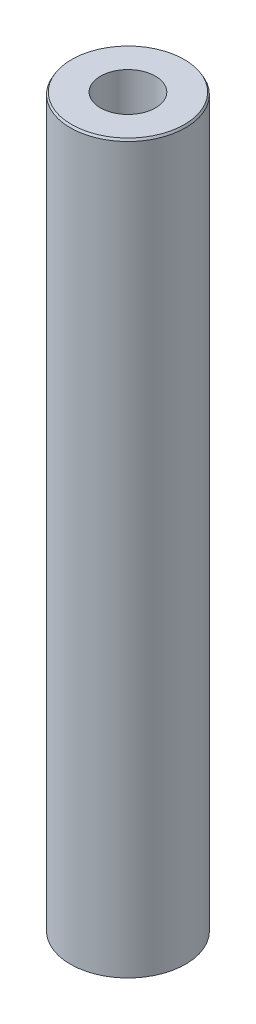
ISO-10303-21;
HEADER;
FILE_DESCRIPTION(('STEP AP214'),'2;1');
FILE_NAME('part.step','',(''),(''),'','','');
FILE_SCHEMA(('AUTOMOTIVE_DESIGN { 1 0 10303 214 1 1 1 1 }'));
ENDSEC;
DATA;
#1=APPLICATION_CONTEXT('core data for automotive mechanical design processes');
#2=APPLICATION_PROTOCOL_DEFINITION('international standard','automotive_design',2000,#1);
#3=PRODUCT_CONTEXT('',#1,'mechanical');
#4=PRODUCT('Part','Part','',(#3));
#5=PRODUCT_RELATED_PRODUCT_CATEGORY('part','',(#4));
#6=PRODUCT_DEFINITION_FORMATION('','',#4);
#7=PRODUCT_DEFINITION_CONTEXT('part definition',#1,'design');
#8=PRODUCT_DEFINITION('design','',#6,#7);
#9=PRODUCT_DEFINITION_SHAPE('','',#8);
#10=(LENGTH_UNIT() NAMED_UNIT(*) SI_UNIT(.MILLI.,.METRE.));
#11=(NAMED_UNIT(*) PLANE_ANGLE_UNIT() SI_UNIT($,.RADIAN.));
#12=(NAMED_UNIT(*) SI_UNIT($,.STERADIAN.) SOLID_ANGLE_UNIT());
#13=UNCERTAINTY_MEASURE_WITH_UNIT(LENGTH_MEASURE(1.E-05),#10,'distance_accuracy_value','');
#14=(GEOMETRIC_REPRESENTATION_CONTEXT(3) GLOBAL_UNCERTAINTY_ASSIGNED_CONTEXT((#13)) GLOBAL_UNIT_ASSIGNED_CONTEXT((#10,
#11,#12)) REPRESENTATION_CONTEXT('',''));
#15=CARTESIAN_POINT('',(0.,0.,0.));
#16=DIRECTION('',(0.,0.,1.));
#17=DIRECTION('',(1.,0.,0.));
#18=AXIS2_PLACEMENT_3D('',#15,#16,#17);
#19=CARTESIAN_POINT('',(0.,600.,0.));
#20=DIRECTION('',(0.,-1.,0.));
#21=DIRECTION('',(0.,0.,-1.));
#22=AXIS2_PLACEMENT_3D('',#19,#20,#21);
#23=CYLINDRICAL_SURFACE('',#22,47.5);
#24=CARTESIAN_POINT('',(0.,598.228684723538,0.));
#25=DIRECTION('',(0.,1.,0.));
#26=DIRECTION('',(0.,0.,1.));
#27=AXIS2_PLACEMENT_3D('',#24,#25,#26);
#28=CIRCLE('',#27,47.5);
#29=CARTESIAN_POINT('',(0.,598.228684723538,47.5));
#30=VERTEX_POINT('',#29);
#31=EDGE_CURVE('E50',#30,#30,#28,.F.);
#32=ORIENTED_EDGE('',*,*,#31,.T.);
#33=EDGE_LOOP('',(#32));
#34=FACE_BOUND('',#33,.T.);
#35=CARTESIAN_POINT('',(0.,1.02266935168505,0.));
#36=DIRECTION('',(0.,1.,0.));
#37=DIRECTION('',(0.,0.,1.));
#38=AXIS2_PLACEMENT_3D('',#35,#36,#37);
#39=CIRCLE('',#38,47.5);
#40=CARTESIAN_POINT('',(0.,1.02266935168505,47.5));
#41=VERTEX_POINT('',#40);
#42=EDGE_CURVE('E51',#41,#41,#39,.T.);
#43=ORIENTED_EDGE('',*,*,#42,.T.);
#44=EDGE_LOOP('',(#43));
#45=FACE_BOUND('',#44,.T.);
#46=ADVANCED_FACE('F39',(#34,#45),#23,.T.);
#47=CARTESIAN_POINT('',(0.,600.,0.));
#48=DIRECTION('',(0.,1.,0.));
#49=DIRECTION('',(0.,0.,1.));
#50=AXIS2_PLACEMENT_3D('',#47,#48,#49);
#51=PLANE('',#50);
#52=CARTESIAN_POINT('',(0.,600.,0.));
#53=DIRECTION('',(0.,1.,0.));
#54=DIRECTION('',(0.,0.,1.));
#55=AXIS2_PLACEMENT_3D('',#52,#53,#54);
#56=CIRCLE('',#55,46.477330648315);
#57=CARTESIAN_POINT('',(0.,600.,46.477330648315));
#58=VERTEX_POINT('',#57);
#59=EDGE_CURVE('E54',#58,#58,#56,.T.);
#60=ORIENTED_EDGE('',*,*,#59,.T.);
#61=EDGE_LOOP('',(#60));
#62=FACE_BOUND('',#61,.T.);
#63=CARTESIAN_POINT('',(0.,600.,0.));
#64=DIRECTION('',(0.,1.,0.));
#65=DIRECTION('',(0.,0.,1.));
#66=AXIS2_PLACEMENT_3D('',#63,#64,#65);
#67=CIRCLE('',#66,22.6806024134489);
#68=CARTESIAN_POINT('',(0.,600.,22.6806024134489));
#69=VERTEX_POINT('',#68);
#70=EDGE_CURVE('E58',#69,#69,#67,.T.);
#71=ORIENTED_EDGE('',*,*,#70,.F.);
#72=EDGE_LOOP('',(#71));
#73=FACE_BOUND('',#72,.T.);
#74=ADVANCED_FACE('F69',(#62,#73),#51,.T.);
#75=CARTESIAN_POINT('',(0.,0.,0.));
#76=DIRECTION('',(0.,1.,0.));
#77=DIRECTION('',(0.,0.,1.));
#78=AXIS2_PLACEMENT_3D('',#75,#76,#77);
#79=PLANE('',#78);
#80=CARTESIAN_POINT('',(0.,0.,0.));
#81=DIRECTION('',(0.,1.,0.));
#82=DIRECTION('',(0.,0.,1.));
#83=AXIS2_PLACEMENT_3D('',#80,#81,#82);
#84=CIRCLE('',#83,45.7286847235381);
#85=CARTESIAN_POINT('',(0.,0.,45.7286847235381));
#86=VERTEX_POINT('',#85);
#87=EDGE_CURVE('E10',#86,#86,#84,.F.);
#88=ORIENTED_EDGE('',*,*,#87,.T.);
#89=EDGE_LOOP('',(#88));
#90=FACE_BOUND('',#89,.T.);
#91=CARTESIAN_POINT('',(0.,0.,0.));
#92=DIRECTION('',(0.,1.,0.));
#93=DIRECTION('',(0.,0.,1.));
#94=AXIS2_PLACEMENT_3D('',#91,#92,#93);
#95=CIRCLE('',#94,22.6806024134489);
#96=CARTESIAN_POINT('',(0.,0.,22.6806024134489));
#97=VERTEX_POINT('',#96);
#98=EDGE_CURVE('E63',#97,#97,#95,.T.);
#99=ORIENTED_EDGE('',*,*,#98,.T.);
#100=EDGE_LOOP('',(#99));
#101=FACE_BOUND('',#100,.T.);
#102=ADVANCED_FACE('F75',(#90,#101),#79,.F.);
#103=CARTESIAN_POINT('',(0.,600.,0.));
#104=DIRECTION('',(0.,-1.,0.));
#105=DIRECTION('',(0.,0.,-1.));
#106=AXIS2_PLACEMENT_3D('',#103,#104,#105);
#107=CYLINDRICAL_SURFACE('',#106,22.6806024134489);
#108=ORIENTED_EDGE('',*,*,#70,.T.);
#109=EDGE_LOOP('',(#108));
#110=FACE_BOUND('',#109,.T.);
#111=ORIENTED_EDGE('',*,*,#98,.F.);
#112=EDGE_LOOP('',(#111));
#113=FACE_BOUND('',#112,.T.);
#114=ADVANCED_FACE('F70',(#110,#113),#107,.F.);
#115=CARTESIAN_POINT('',(0.,600.,0.));
#116=DIRECTION('',(0.,-1.,0.));
#117=DIRECTION('',(0.,0.,-1.));
#118=AXIS2_PLACEMENT_3D('',#115,#116,#117);
#119=CONICAL_SURFACE('',#118,46.477330648315,0.523598775598286);
#120=ORIENTED_EDGE('',*,*,#31,.F.);
#121=EDGE_LOOP('',(#120));
#122=FACE_BOUND('',#121,.T.);
#123=ORIENTED_EDGE('',*,*,#59,.F.);
#124=EDGE_LOOP('',(#123));
#125=FACE_BOUND('',#124,.T.);
#126=ADVANCED_FACE('F81',(#122,#125),#119,.T.);
#127=CARTESIAN_POINT('',(0.,1.02266935168505,0.));
#128=DIRECTION('',(0.,1.,0.));
#129=DIRECTION('',(0.,0.,1.));
#130=AXIS2_PLACEMENT_3D('',#127,#128,#129);
#131=CONICAL_SURFACE('',#130,47.5,1.04719755119657);
#132=ORIENTED_EDGE('',*,*,#87,.F.);
#133=EDGE_LOOP('',(#132));
#134=FACE_BOUND('',#133,.T.);
#135=ORIENTED_EDGE('',*,*,#42,.F.);
#136=EDGE_LOOP('',(#135));
#137=FACE_BOUND('',#136,.T.);
#138=ADVANCED_FACE('F45',(#134,#137),#131,.T.);
#139=CLOSED_SHELL('',(#46,#74,#102,#114,#126,#138));
#140=MANIFOLD_SOLID_BREP('B2',#139);
#141=ADVANCED_BREP_SHAPE_REPRESENTATION('',(#18,#140),#14);
#142=SHAPE_DEFINITION_REPRESENTATION(#9,#141);
ENDSEC;
END-ISO-10303-21;
